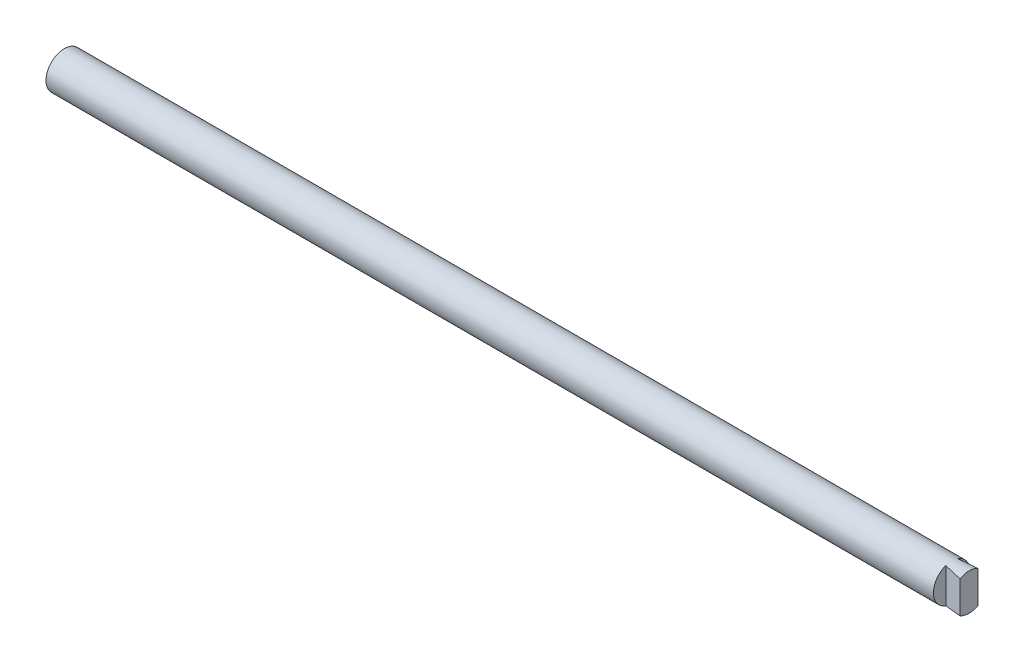
ISO-10303-21;
HEADER;
FILE_DESCRIPTION(('STEP AP214'),'2;1');
FILE_NAME('part.step','',(''),(''),'','','');
FILE_SCHEMA(('AUTOMOTIVE_DESIGN { 1 0 10303 214 1 1 1 1 }'));
ENDSEC;
DATA;
#1=APPLICATION_CONTEXT('core data for automotive mechanical design processes');
#2=APPLICATION_PROTOCOL_DEFINITION('international standard','automotive_design',2000,#1);
#3=PRODUCT_CONTEXT('',#1,'mechanical');
#4=PRODUCT('Part','Part','',(#3));
#5=PRODUCT_RELATED_PRODUCT_CATEGORY('part','',(#4));
#6=PRODUCT_DEFINITION_FORMATION('','',#4);
#7=PRODUCT_DEFINITION_CONTEXT('part definition',#1,'design');
#8=PRODUCT_DEFINITION('design','',#6,#7);
#9=PRODUCT_DEFINITION_SHAPE('','',#8);
#10=(LENGTH_UNIT() NAMED_UNIT(*) SI_UNIT(.MILLI.,.METRE.));
#11=(NAMED_UNIT(*) PLANE_ANGLE_UNIT() SI_UNIT($,.RADIAN.));
#12=(NAMED_UNIT(*) SI_UNIT($,.STERADIAN.) SOLID_ANGLE_UNIT());
#13=UNCERTAINTY_MEASURE_WITH_UNIT(LENGTH_MEASURE(1.E-05),#10,'distance_accuracy_value','');
#14=(GEOMETRIC_REPRESENTATION_CONTEXT(3) GLOBAL_UNCERTAINTY_ASSIGNED_CONTEXT((#13)) GLOBAL_UNIT_ASSIGNED_CONTEXT((#10,
#11,#12)) REPRESENTATION_CONTEXT('',''));
#15=CARTESIAN_POINT('',(0.,0.,0.));
#16=DIRECTION('',(0.,0.,1.));
#17=DIRECTION('',(1.,0.,0.));
#18=AXIS2_PLACEMENT_3D('',#15,#16,#17);
#19=CARTESIAN_POINT('',(196.580346973998,-4.,-1.95998707108837));
#20=DIRECTION('',(-1.,0.,0.));
#21=DIRECTION('',(0.,0.,1.));
#22=AXIS2_PLACEMENT_3D('',#19,#20,#21);
#23=PLANE('',#22);
#24=DIRECTION('',(0.,1.,0.));
#25=VECTOR('',#24,1.);
#26=CARTESIAN_POINT('',(196.580346973998,-4.,1.95998707108837));
#27=LINE('',#26,#25);
#28=CARTESIAN_POINT('',(196.580346973998,-3.48689699893278,1.95998707108837));
#29=VERTEX_POINT('',#28);
#30=CARTESIAN_POINT('',(196.580346973998,3.48689699893278,1.95998707108837));
#31=VERTEX_POINT('',#30);
#32=EDGE_CURVE('E85',#29,#31,#27,.T.);
#33=ORIENTED_EDGE('',*,*,#32,.F.);
#34=CARTESIAN_POINT('',(196.580346973998,0.,0.));
#35=DIRECTION('',(-1.,0.,0.));
#36=DIRECTION('',(0.,0.,1.));
#37=AXIS2_PLACEMENT_3D('',#34,#35,#36);
#38=CIRCLE('',#37,4.);
#39=CARTESIAN_POINT('',(196.580346973998,-3.48689699893278,-1.95998707108837));
#40=VERTEX_POINT('',#39);
#41=EDGE_CURVE('E56',#40,#29,#38,.T.);
#42=ORIENTED_EDGE('',*,*,#41,.F.);
#43=DIRECTION('',(0.,1.,0.));
#44=VECTOR('',#43,1.);
#45=CARTESIAN_POINT('',(196.580346973998,-4.,-1.95998707108837));
#46=LINE('',#45,#44);
#47=CARTESIAN_POINT('',(196.580346973998,3.48689699893278,-1.95998707108837));
#48=VERTEX_POINT('',#47);
#49=EDGE_CURVE('E88',#40,#48,#46,.T.);
#50=ORIENTED_EDGE('',*,*,#49,.T.);
#51=EDGE_CURVE('E83',#31,#48,#38,.T.);
#52=ORIENTED_EDGE('',*,*,#51,.F.);
#53=EDGE_LOOP('',(#33,#42,#50,#52));
#54=FACE_BOUND('',#53,.T.);
#55=ADVANCED_FACE('F40',(#54),#23,.F.);
#56=CARTESIAN_POINT('',(192.837374296552,-4.,-1.30000000000004));
#57=DIRECTION('',(-0.999986160666897,0.,-0.00526103361312539));
#58=DIRECTION('',(-0.00526103361312539,0.,0.999986160666897));
#59=AXIS2_PLACEMENT_3D('',#56,#57,#58);
#60=PLANE('',#59);
#61=DIRECTION('',(0.,1.,0.));
#62=VECTOR('',#61,1.);
#63=CARTESIAN_POINT('',(192.837374296552,-4.,-1.30000000000004));
#64=LINE('',#63,#62);
#65=CARTESIAN_POINT('',(192.837374296552,-3.78285606387553,-1.30000000000004));
#66=VERTEX_POINT('',#65);
#67=CARTESIAN_POINT('',(192.837374296552,3.78285606387553,-1.30000000000004));
#68=VERTEX_POINT('',#67);
#69=EDGE_CURVE('E107',#66,#68,#64,.T.);
#70=ORIENTED_EDGE('',*,*,#69,.F.);
#71=CARTESIAN_POINT('',(192.830534858202,0.,0.));
#72=DIRECTION('',(-0.999986160666897,0.,-0.00526103361312539));
#73=DIRECTION('',(-0.00526103361312539,0.,0.999986160666897));
#74=AXIS2_PLACEMENT_3D('',#71,#72,#73);
#75=ELLIPSE('',#74,4.00005535809853,4.);
#76=EDGE_CURVE('E63',#68,#66,#75,.T.);
#77=ORIENTED_EDGE('',*,*,#76,.F.);
#78=EDGE_LOOP('',(#70,#77));
#79=FACE_BOUND('',#78,.T.);
#80=ADVANCED_FACE('F113',(#79),#60,.F.);
#81=CARTESIAN_POINT('',(192.837374296552,-4.,-1.30000000000004));
#82=DIRECTION('',(0.173648177666931,0.,0.984807753012208));
#83=DIRECTION('',(0.984807753012208,0.,-0.173648177666931));
#84=AXIS2_PLACEMENT_3D('',#81,#82,#83);
#85=PLANE('',#84);
#86=ORIENTED_EDGE('',*,*,#69,.T.);
#87=CARTESIAN_POINT('',(185.464707931049,0.,0.));
#88=DIRECTION('',(0.173648177666931,0.,0.984807753012208));
#89=DIRECTION('',(-0.984807753012208,0.,0.173648177666931));
#90=AXIS2_PLACEMENT_3D('',#87,#88,#89);
#91=ELLIPSE('',#90,23.0350819325744,4.);
#92=EDGE_CURVE('E90',#48,#68,#91,.T.);
#93=ORIENTED_EDGE('',*,*,#92,.F.);
#94=ORIENTED_EDGE('',*,*,#49,.F.);
#95=EDGE_CURVE('E101',#66,#40,#91,.T.);
#96=ORIENTED_EDGE('',*,*,#95,.F.);
#97=EDGE_LOOP('',(#86,#93,#94,#96));
#98=FACE_BOUND('',#97,.T.);
#99=ADVANCED_FACE('F112',(#98),#85,.F.);
#100=CARTESIAN_POINT('',(196.580346973998,-4.,1.95998707108837));
#101=DIRECTION('',(0.173648177666922,0.,-0.98480775301221));
#102=DIRECTION('',(-0.98480775301221,0.,-0.173648177666922));
#103=AXIS2_PLACEMENT_3D('',#100,#101,#102);
#104=PLANE('',#103);
#105=DIRECTION('',(0.,1.,0.));
#106=VECTOR('',#105,1.);
#107=CARTESIAN_POINT('',(192.837374296552,-4.,1.30000000000003));
#108=LINE('',#107,#106);
#109=CARTESIAN_POINT('',(192.837374296552,-3.78285606387554,1.30000000000003));
#110=VERTEX_POINT('',#109);
#111=CARTESIAN_POINT('',(192.837374296552,3.78285606387553,1.30000000000003));
#112=VERTEX_POINT('',#111);
#113=EDGE_CURVE('E98',#110,#112,#108,.T.);
#114=ORIENTED_EDGE('',*,*,#113,.F.);
#115=CARTESIAN_POINT('',(185.464707931048,0.,0.));
#116=DIRECTION('',(0.173648177666922,0.,-0.98480775301221));
#117=DIRECTION('',(-0.98480775301221,0.,-0.173648177666922));
#118=AXIS2_PLACEMENT_3D('',#115,#116,#117);
#119=ELLIPSE('',#118,23.0350819325756,4.);
#120=EDGE_CURVE('E49',#29,#110,#119,.T.);
#121=ORIENTED_EDGE('',*,*,#120,.F.);
#122=ORIENTED_EDGE('',*,*,#32,.T.);
#123=EDGE_CURVE('E11',#112,#31,#119,.T.);
#124=ORIENTED_EDGE('',*,*,#123,.F.);
#125=EDGE_LOOP('',(#114,#121,#122,#124));
#126=FACE_BOUND('',#125,.T.);
#127=ADVANCED_FACE('F96',(#126),#104,.F.);
#128=CARTESIAN_POINT('',(192.837374296552,-4.,1.30000000000003));
#129=DIRECTION('',(-0.999985826188054,0.,0.00532422980296226));
#130=DIRECTION('',(0.00532422980296226,0.,0.999985826188054));
#131=AXIS2_PLACEMENT_3D('',#128,#129,#130);
#132=PLANE('',#131);
#133=ORIENTED_EDGE('',*,*,#113,.T.);
#134=CARTESIAN_POINT('',(192.830452699702,0.,0.));
#135=DIRECTION('',(-0.999985826188054,0.,0.00532422980296226));
#136=DIRECTION('',(-0.00532422980296226,0.,-0.999985826188054));
#137=AXIS2_PLACEMENT_3D('',#134,#135,#136);
#138=ELLIPSE('',#137,4.00005669605138,4.);
#139=EDGE_CURVE('E44',#110,#112,#138,.T.);
#140=ORIENTED_EDGE('',*,*,#139,.F.);
#141=EDGE_LOOP('',(#133,#140));
#142=FACE_BOUND('',#141,.T.);
#143=ADVANCED_FACE('F125',(#142),#132,.F.);
#144=CARTESIAN_POINT('',(400.,0.,0.));
#145=DIRECTION('',(-1.,0.,0.));
#146=DIRECTION('',(0.,0.,1.));
#147=AXIS2_PLACEMENT_3D('',#144,#145,#146);
#148=CYLINDRICAL_SURFACE('',#147,4.);
#149=CARTESIAN_POINT('',(0.,0.,0.));
#150=DIRECTION('',(1.,0.,0.));
#151=DIRECTION('',(0.,0.,-1.));
#152=AXIS2_PLACEMENT_3D('',#149,#150,#151);
#153=CIRCLE('',#152,4.);
#154=CARTESIAN_POINT('',(0.,0.,-4.));
#155=VERTEX_POINT('',#154);
#156=EDGE_CURVE('E91',#155,#155,#153,.T.);
#157=ORIENTED_EDGE('',*,*,#156,.T.);
#158=EDGE_LOOP('',(#157));
#159=FACE_BOUND('',#158,.T.);
#160=ORIENTED_EDGE('',*,*,#123,.T.);
#161=ORIENTED_EDGE('',*,*,#51,.T.);
#162=ORIENTED_EDGE('',*,*,#92,.T.);
#163=ORIENTED_EDGE('',*,*,#76,.T.);
#164=ORIENTED_EDGE('',*,*,#95,.T.);
#165=ORIENTED_EDGE('',*,*,#41,.T.);
#166=ORIENTED_EDGE('',*,*,#120,.T.);
#167=ORIENTED_EDGE('',*,*,#139,.T.);
#168=EDGE_LOOP('',(#160,#161,#162,#163,#164,#165,#166,#167));
#169=FACE_BOUND('',#168,.T.);
#170=ADVANCED_FACE('F42',(#159,#169),#148,.T.);
#171=CARTESIAN_POINT('',(0.,0.,0.));
#172=DIRECTION('',(1.,0.,0.));
#173=DIRECTION('',(0.,0.,-1.));
#174=AXIS2_PLACEMENT_3D('',#171,#172,#173);
#175=PLANE('',#174);
#176=ORIENTED_EDGE('',*,*,#156,.F.);
#177=EDGE_LOOP('',(#176));
#178=FACE_BOUND('',#177,.T.);
#179=ADVANCED_FACE('F124',(#178),#175,.F.);
#180=CLOSED_SHELL('',(#55,#80,#99,#127,#143,#170,#179));
#181=MANIFOLD_SOLID_BREP('B2',#180);
#182=ADVANCED_BREP_SHAPE_REPRESENTATION('',(#18,#181),#14);
#183=SHAPE_DEFINITION_REPRESENTATION(#9,#182);
ENDSEC;
END-ISO-10303-21;
